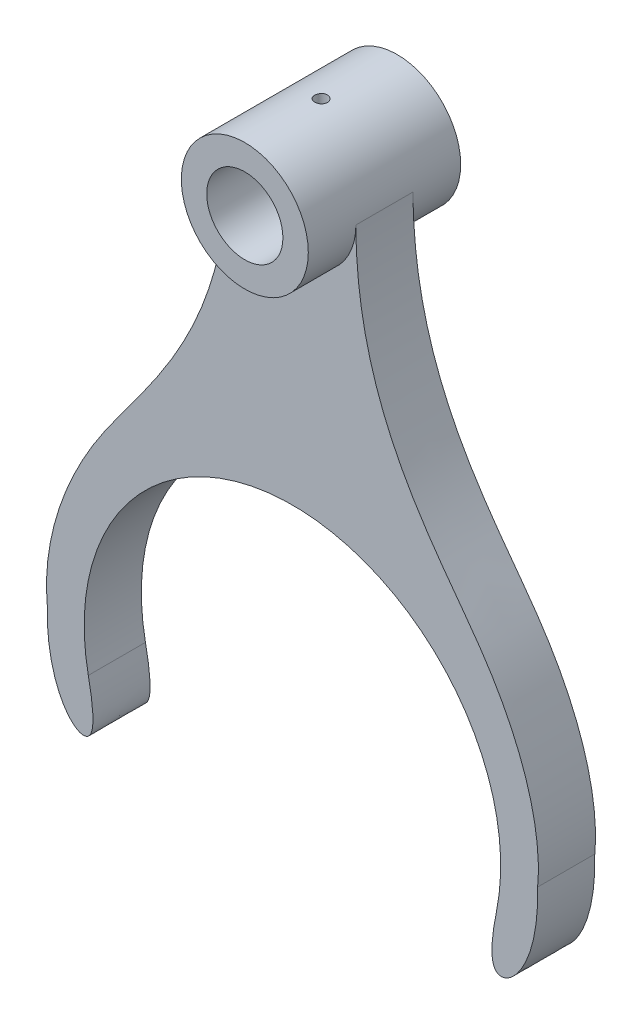
ISO-10303-21;
HEADER;
FILE_DESCRIPTION(('STEP AP214'),'2;1');
FILE_NAME('part.step','',(''),(''),'','','');
FILE_SCHEMA(('AUTOMOTIVE_DESIGN { 1 0 10303 214 1 1 1 1 }'));
ENDSEC;
DATA;
#1=APPLICATION_CONTEXT('core data for automotive mechanical design processes');
#2=APPLICATION_PROTOCOL_DEFINITION('international standard','automotive_design',2000,#1);
#3=PRODUCT_CONTEXT('',#1,'mechanical');
#4=PRODUCT('Part','Part','',(#3));
#5=PRODUCT_RELATED_PRODUCT_CATEGORY('part','',(#4));
#6=PRODUCT_DEFINITION_FORMATION('','',#4);
#7=PRODUCT_DEFINITION_CONTEXT('part definition',#1,'design');
#8=PRODUCT_DEFINITION('design','',#6,#7);
#9=PRODUCT_DEFINITION_SHAPE('','',#8);
#10=(LENGTH_UNIT() NAMED_UNIT(*) SI_UNIT(.MILLI.,.METRE.));
#11=(NAMED_UNIT(*) PLANE_ANGLE_UNIT() SI_UNIT($,.RADIAN.));
#12=(NAMED_UNIT(*) SI_UNIT($,.STERADIAN.) SOLID_ANGLE_UNIT());
#13=UNCERTAINTY_MEASURE_WITH_UNIT(LENGTH_MEASURE(1.E-05),#10,'distance_accuracy_value','');
#14=(GEOMETRIC_REPRESENTATION_CONTEXT(3) GLOBAL_UNCERTAINTY_ASSIGNED_CONTEXT((#13)) GLOBAL_UNIT_ASSIGNED_CONTEXT((#10,
#11,#12)) REPRESENTATION_CONTEXT('',''));
#15=CARTESIAN_POINT('',(0.,0.,0.));
#16=DIRECTION('',(0.,0.,1.));
#17=DIRECTION('',(1.,0.,0.));
#18=AXIS2_PLACEMENT_3D('',#15,#16,#17);
#19=CARTESIAN_POINT('',(0.,190.,30.));
#20=DIRECTION('',(0.,0.,-1.));
#21=DIRECTION('',(-1.,0.,0.));
#22=AXIS2_PLACEMENT_3D('',#19,#20,#21);
#23=CYLINDRICAL_SURFACE('',#22,15.);
#24=CARTESIAN_POINT('',(0.,190.,-30.));
#25=DIRECTION('',(0.,0.,1.));
#26=DIRECTION('',(1.,0.,0.));
#27=AXIS2_PLACEMENT_3D('',#24,#25,#26);
#28=CIRCLE('',#27,15.);
#29=CARTESIAN_POINT('',(15.,190.,-30.));
#30=VERTEX_POINT('',#29);
#31=EDGE_CURVE('E238',#30,#30,#28,.T.);
#32=ORIENTED_EDGE('',*,*,#31,.F.);
#33=EDGE_LOOP('',(#32));
#34=FACE_BOUND('',#33,.T.);
#35=CARTESIAN_POINT('',(0.,190.,30.));
#36=DIRECTION('',(0.,0.,1.));
#37=DIRECTION('',(1.,0.,0.));
#38=AXIS2_PLACEMENT_3D('',#35,#36,#37);
#39=CIRCLE('',#38,15.);
#40=CARTESIAN_POINT('',(15.,190.,30.));
#41=VERTEX_POINT('',#40);
#42=EDGE_CURVE('E237',#41,#41,#39,.T.);
#43=ORIENTED_EDGE('',*,*,#42,.T.);
#44=EDGE_LOOP('',(#43));
#45=FACE_BOUND('',#44,.T.);
#46=CARTESIAN_POINT('',(0.,205.,-2.5));
#47=CARTESIAN_POINT('',(-0.139390904958215,204.999997611688,-2.49999441105218));
#48=CARTESIAN_POINT('',(-0.278857881838821,204.99803677913,-2.48830272503108));
#49=CARTESIAN_POINT('',(-0.553880221673043,204.990403449414,-2.44186434123467));
#50=CARTESIAN_POINT('',(-0.689431867959247,204.984727539239,-2.4070964430884));
#51=CARTESIAN_POINT('',(-0.952604747212644,204.970300682365,-2.31558455140725));
#52=CARTESIAN_POINT('',(-1.0802323684319,204.961552251592,-2.25885853435943));
#53=CARTESIAN_POINT('',(-1.32414184197795,204.941942270821,-2.1250877079476));
#54=CARTESIAN_POINT('',(-1.44042498987859,204.931080962544,-2.048045222517));
#55=CARTESIAN_POINT('',(-1.65947261429168,204.908333174583,-1.87504491617954));
#56=CARTESIAN_POINT('',(-1.76211290353497,204.896438718149,-1.77893088536387));
#57=CARTESIAN_POINT('',(-1.94988849865993,204.873026268767,-1.57085203152719));
#58=CARTESIAN_POINT('',(-2.03502269939097,204.861508299627,-1.45888620854339));
#59=CARTESIAN_POINT('',(-2.18586712560513,204.840075657598,-1.22142903380295));
#60=CARTESIAN_POINT('',(-2.251454552861,204.830171290916,-1.09585866319525));
#61=CARTESIAN_POINT('',(-2.36055836541122,204.813197897947,-0.835290435699375));
#62=CARTESIAN_POINT('',(-2.40407624156561,204.806128680143,-0.700293216322369));
#63=CARTESIAN_POINT('',(-2.46741437778481,204.795705368428,-0.426019725143461));
#64=CARTESIAN_POINT('',(-2.4874490291354,204.792317684857,-0.286794263498608));
#65=CARTESIAN_POINT('',(-2.50391672528988,204.789539389366,-0.00691972311652866));
#66=CARTESIAN_POINT('',(-2.500351440389,204.790148494572,0.133729254167299));
#67=CARTESIAN_POINT('',(-2.46989509839615,204.795264288636,0.410927861275449));
#68=CARTESIAN_POINT('',(-2.44324488188977,204.799730733189,0.547504803545233));
#69=CARTESIAN_POINT('',(-2.36775314040344,204.81199495211,0.814221317829134));
#70=CARTESIAN_POINT('',(-2.31891085431974,204.819792840733,0.944360668888546));
#71=CARTESIAN_POINT('',(-2.20017724609391,204.837884793341,1.19522882344092));
#72=CARTESIAN_POINT('',(-2.13018591387971,204.848190671073,1.31590940608123));
#73=CARTESIAN_POINT('',(-1.97121201755743,204.87012918415,1.54390440053839));
#74=CARTESIAN_POINT('',(-1.88222792065429,204.881761926543,1.65121773245493));
#75=CARTESIAN_POINT('',(-1.68648221215905,204.905220278798,1.85082608580735));
#76=CARTESIAN_POINT('',(-1.57951396387313,204.917046492317,1.94291851854008));
#77=CARTESIAN_POINT('',(-1.35153524898165,204.939426013967,2.10787776266534));
#78=CARTESIAN_POINT('',(-1.23052469190642,204.949979313898,2.18074445018323));
#79=CARTESIAN_POINT('',(-0.977705916166711,204.968638928929,2.30520222713628));
#80=CARTESIAN_POINT('',(-0.84588872556466,204.976743184075,2.35677541933126));
#81=CARTESIAN_POINT('',(-0.57529834560273,204.989575030127,2.43699421524598));
#82=CARTESIAN_POINT('',(-0.436525739179467,204.994302903505,2.46564173697372));
#83=CARTESIAN_POINT('',(-0.157709901301624,204.999811298427,2.49892135846113));
#84=CARTESIAN_POINT('',(-0.0177007371510114,205.000637530128,2.50383157180561));
#85=CARTESIAN_POINT('',(0.261139772889887,204.998374744212,2.49023865557188));
#86=CARTESIAN_POINT('',(0.399971163892038,204.995285877241,2.47173642686626));
#87=CARTESIAN_POINT('',(0.671656175546764,204.985568269382,2.41207515066452));
#88=CARTESIAN_POINT('',(0.80454086838538,204.978961048013,2.37105379160987));
#89=CARTESIAN_POINT('',(1.06154688486044,204.962944644554,2.26766548180047));
#90=CARTESIAN_POINT('',(1.18566771590972,204.95353530512,2.20529733236473));
#91=CARTESIAN_POINT('',(1.42283068946896,204.932845163024,2.06034887530321));
#92=CARTESIAN_POINT('',(1.53576525093715,204.92154855887,1.97759484383275));
#93=CARTESIAN_POINT('',(1.74624358550269,204.898384673919,1.79446268461494));
#94=CARTESIAN_POINT('',(1.84378623969658,204.886517351715,1.69408327672333));
#95=CARTESIAN_POINT('',(2.021742779658,204.863401752358,1.47730245192858));
#96=CARTESIAN_POINT('',(2.10196876111372,204.852161161371,1.36074583448559));
#97=CARTESIAN_POINT('',(2.24170231029499,204.831715297779,1.11564703086146));
#98=CARTESIAN_POINT('',(2.30121053476982,204.82250996066,0.987105224772504));
#99=CARTESIAN_POINT('',(2.39753833147315,204.807234536977,0.722210267187867));
#100=CARTESIAN_POINT('',(2.43445143254795,204.801151543111,0.585891904969511));
#101=CARTESIAN_POINT('',(2.48483545377828,204.792777168353,0.308879870778237));
#102=CARTESIAN_POINT('',(2.49830841194617,204.790485457827,0.168186580267947));
#103=CARTESIAN_POINT('',(2.50137286604735,204.78996733084,-0.11170516596241));
#104=CARTESIAN_POINT('',(2.49126013612519,204.791690565057,-0.25090037857529));
#105=CARTESIAN_POINT('',(2.44807983895685,204.798897814537,-0.525579248050767));
#106=CARTESIAN_POINT('',(2.41501234611248,204.804381817612,-0.661062916941873));
#107=CARTESIAN_POINT('',(2.3269744895949,204.818473562817,-0.924358437292615));
#108=CARTESIAN_POINT('',(2.27202959060044,204.827077672197,-1.05217901005603));
#109=CARTESIAN_POINT('',(2.14182700391591,204.846443689222,-1.29683566919485));
#110=CARTESIAN_POINT('',(2.06656830874856,204.857205703884,-1.41367121037214));
#111=CARTESIAN_POINT('',(1.89681888437215,204.879834540456,-1.63453558310776));
#112=CARTESIAN_POINT('',(1.80211056359364,204.891712955763,-1.73839601670028));
#113=CARTESIAN_POINT('',(1.59660903138023,204.915143723608,-1.92885160447494));
#114=CARTESIAN_POINT('',(1.48581211291263,204.926696000266,-2.01544276863817));
#115=CARTESIAN_POINT('',(1.25036916964028,204.948265296422,-2.16944826819995));
#116=CARTESIAN_POINT('',(1.12563278753281,204.958271162531,-2.23672603931295));
#117=CARTESIAN_POINT('',(0.866513069378978,204.975511676018,-2.34926948460992));
#118=CARTESIAN_POINT('',(0.732139494830007,204.982749081775,-2.3945570810797));
#119=CARTESIAN_POINT('',(0.497703310045399,204.99205790833,-2.45200527412667));
#120=CARTESIAN_POINT('',(0.399058830298446,204.995020272734,-2.46997446961596));
#121=CARTESIAN_POINT('',(0.200289310319808,204.998992159861,-2.49397373784475));
#122=CARTESIAN_POINT('',(0.100164295608494,205.000001716206,-2.50000401613736));
#123=CARTESIAN_POINT('',(0.,205.,-2.5));
#124=B_SPLINE_CURVE_WITH_KNOTS('',3,(#46,#47,#48,#49,#50,#51,#52,#53,#54,#55,#56,#57,#58,#59,
#60,#61,#62,#63,#64,#65,#66,#67,#68,#69,#70,#71,#72,#73,#74,#75,#76,#77,#78,#79,#80,#81,#82,#83,
#84,#85,#86,#87,#88,#89,#90,#91,#92,#93,#94,#95,#96,#97,#98,#99,#100,#101,#102,#103,#104,#105,
#106,#107,#108,#109,#110,#111,#112,#113,#114,#115,#116,#117,#118,#119,#120,#121,#122,#123),
.UNSPECIFIED.,.T.,.F.,(4,2,2,2,2,2,2,2,2,2,2,2,2,2,2,2,2,2,2,2,2,2,2,2,2,2,2,2,2,2,2,2,2,2,2,2,
2,2,4),(0.,0.41780658493851,0.83599754569542,1.25384686702527,1.67164841267479,2.09302491062332,
2.51442800169856,2.9384252082384,3.36239376876181,3.78246077103424,4.20249804320886,
4.61820521760409,5.03392665025381,5.45164556632557,5.86939820680573,6.29232769911326,
6.71525991635847,7.13854688915903,7.56179844521149,7.98007883491397,8.39834313035859,
8.81407807006415,9.22983635826066,9.64926825627023,10.0687306305428,10.4925382200762,
10.9163323737594,11.3383602234177,11.7603513778662,12.177079095227,12.5938054618813,
13.0100481822622,13.4263115502934,13.8475138419339,14.2688133387897,14.693022316072,
15.1168075213007,15.4170424816402,15.7172722727697),.UNSPECIFIED.);
#125=CARTESIAN_POINT('',(0.,205.,-2.5));
#126=VERTEX_POINT('',#125);
#127=EDGE_CURVE('E242',#126,#126,#124,.T.);
#128=ORIENTED_EDGE('',*,*,#127,.T.);
#129=EDGE_LOOP('',(#128));
#130=FACE_BOUND('',#129,.T.);
#131=ADVANCED_FACE('F45',(#34,#45,#130),#23,.F.);
#132=CARTESIAN_POINT('',(0.,190.,30.));
#133=DIRECTION('',(0.,0.,-1.));
#134=DIRECTION('',(-1.,0.,0.));
#135=AXIS2_PLACEMENT_3D('',#132,#133,#134);
#136=CYLINDRICAL_SURFACE('',#135,25.);
#137=CARTESIAN_POINT('',(0.,190.,11.25));
#138=DIRECTION('',(0.,0.,1.));
#139=DIRECTION('',(1.,0.,0.));
#140=AXIS2_PLACEMENT_3D('',#137,#138,#139);
#141=CIRCLE('',#140,25.);
#142=CARTESIAN_POINT('',(-25.,190.,11.25));
#143=VERTEX_POINT('',#142);
#144=CARTESIAN_POINT('',(25.,190.,11.25));
#145=VERTEX_POINT('',#144);
#146=EDGE_CURVE('E219',#143,#145,#141,.T.);
#147=ORIENTED_EDGE('',*,*,#146,.T.);
#148=DIRECTION('',(0.,0.,-1.));
#149=VECTOR('',#148,1.);
#150=CARTESIAN_POINT('',(25.,190.,11.25));
#151=LINE('',#150,#149);
#152=CARTESIAN_POINT('',(25.,190.,-11.25));
#153=VERTEX_POINT('',#152);
#154=EDGE_CURVE('E116',#145,#153,#151,.T.);
#155=ORIENTED_EDGE('',*,*,#154,.T.);
#156=CARTESIAN_POINT('',(0.,190.,-11.25));
#157=DIRECTION('',(0.,0.,1.));
#158=DIRECTION('',(1.,0.,0.));
#159=AXIS2_PLACEMENT_3D('',#156,#157,#158);
#160=CIRCLE('',#159,25.);
#161=CARTESIAN_POINT('',(-25.,190.,-11.25));
#162=VERTEX_POINT('',#161);
#163=EDGE_CURVE('E109',#162,#153,#160,.T.);
#164=ORIENTED_EDGE('',*,*,#163,.F.);
#165=DIRECTION('',(0.,0.,-1.));
#166=VECTOR('',#165,1.);
#167=CARTESIAN_POINT('',(-25.,190.,11.25));
#168=LINE('',#167,#166);
#169=EDGE_CURVE('E113',#143,#162,#168,.T.);
#170=ORIENTED_EDGE('',*,*,#169,.F.);
#171=EDGE_LOOP('',(#147,#155,#164,#170));
#172=FACE_BOUND('',#171,.T.);
#173=CARTESIAN_POINT('',(0.,190.,30.));
#174=DIRECTION('',(0.,0.,1.));
#175=DIRECTION('',(1.,0.,0.));
#176=AXIS2_PLACEMENT_3D('',#173,#174,#175);
#177=CIRCLE('',#176,25.);
#178=CARTESIAN_POINT('',(25.,190.,30.));
#179=VERTEX_POINT('',#178);
#180=EDGE_CURVE('E171',#179,#179,#177,.T.);
#181=ORIENTED_EDGE('',*,*,#180,.F.);
#182=EDGE_LOOP('',(#181));
#183=FACE_BOUND('',#182,.T.);
#184=CARTESIAN_POINT('',(0.,190.,-30.));
#185=DIRECTION('',(0.,0.,1.));
#186=DIRECTION('',(1.,0.,0.));
#187=AXIS2_PLACEMENT_3D('',#184,#185,#186);
#188=CIRCLE('',#187,25.);
#189=CARTESIAN_POINT('',(25.,190.,-30.));
#190=VERTEX_POINT('',#189);
#191=EDGE_CURVE('E233',#190,#190,#188,.T.);
#192=ORIENTED_EDGE('',*,*,#191,.T.);
#193=EDGE_LOOP('',(#192));
#194=FACE_BOUND('',#193,.T.);
#195=CARTESIAN_POINT('',(0.,215.,-2.5));
#196=CARTESIAN_POINT('',(-0.140050884478893,214.999998388019,-2.49999393524905));
#197=CARTESIAN_POINT('',(-0.280194362919433,214.998810639905,-2.48819182775889));
#198=CARTESIAN_POINT('',(-0.556595996242093,214.994186689868,-2.44128907427393));
#199=CARTESIAN_POINT('',(-0.69284969792207,214.990748010851,-2.40616275993853));
#200=CARTESIAN_POINT('',(-0.957429188633537,214.982010364077,-2.31364439850542));
#201=CARTESIAN_POINT('',(-1.08575971153727,214.976712520018,-2.25626579870381));
#202=CARTESIAN_POINT('',(-1.33094040240102,214.964848934858,-2.12089773017089));
#203=CARTESIAN_POINT('',(-1.44779284694769,214.958283445953,-2.04291235999965));
#204=CARTESIAN_POINT('',(-1.66714887668521,214.944593608533,-1.86824325584431));
#205=CARTESIAN_POINT('',(-1.76960536208723,214.937467539347,-1.77150050149491));
#206=CARTESIAN_POINT('',(-1.95685630357746,214.923473922657,-1.56218866434242));
#207=CARTESIAN_POINT('',(-2.04164994270663,214.916606387123,-1.44961884989403));
#208=CARTESIAN_POINT('',(-2.19133492610904,214.90388978882,-1.21155367079095));
#209=CARTESIAN_POINT('',(-2.2561836636372,214.898042917773,-1.08603138976285));
#210=CARTESIAN_POINT('',(-2.3638659618569,214.888050938663,-0.825811035237551));
#211=CARTESIAN_POINT('',(-2.40670006647823,214.883905788556,-0.691113188540124));
#212=CARTESIAN_POINT('',(-2.46899760400473,214.877802101824,-0.416845497834975));
#213=CARTESIAN_POINT('',(-2.48853913250949,214.875836259952,-0.277293557869478));
#214=CARTESIAN_POINT('',(-2.5039382128384,214.874291076513,0.00312215848945237));
#215=CARTESIAN_POINT('',(-2.499796387177,214.874711672219,0.143985900305149));
#216=CARTESIAN_POINT('',(-2.4680107006317,214.877885172473,0.422488274233296));
#217=CARTESIAN_POINT('',(-2.44045211031138,214.880629614766,0.560136748321736));
#218=CARTESIAN_POINT('',(-2.36274786037647,214.888128357185,0.828844908002735));
#219=CARTESIAN_POINT('',(-2.31260189563937,214.892882684462,0.959904504562579));
#220=CARTESIAN_POINT('',(-2.19105223470377,214.903875236302,1.21198396824722));
#221=CARTESIAN_POINT('',(-2.11961070679995,214.910116097704,1.33298547372329));
#222=CARTESIAN_POINT('',(-1.95752506838307,214.923376293322,1.56131303727971));
#223=CARTESIAN_POINT('',(-1.86688039584126,214.93039565032,1.66863869495441));
#224=CARTESIAN_POINT('',(-1.66848528103017,214.944459632825,1.86706348497257));
#225=CARTESIAN_POINT('',(-1.56066119712841,214.951504233325,1.95808900470201));
#226=CARTESIAN_POINT('',(-1.33122370434278,214.964795726963,2.12075908227597));
#227=CARTESIAN_POINT('',(-1.209610279999,214.971042619206,2.19240361839119));
#228=CARTESIAN_POINT('',(-0.955995264230911,214.982036891677,2.31427505077563));
#229=CARTESIAN_POINT('',(-0.823991865974757,214.986784010369,2.36449821204515));
#230=CARTESIAN_POINT('',(-0.553368043324829,214.994241186035,2.44204729177938));
#231=CARTESIAN_POINT('',(-0.4147478169415,214.996951303927,2.46937389497656));
#232=CARTESIAN_POINT('',(-0.135462747729759,215.000021291708,2.50026076933691));
#233=CARTESIAN_POINT('',(0.00519075526373068,215.000391206693,2.50392262063125));
#234=CARTESIAN_POINT('',(0.28510948328925,214.99876604392,2.48764284237809));
#235=CARTESIAN_POINT('',(0.424374727051175,214.996770998112,2.4677015317118));
#236=CARTESIAN_POINT('',(0.697270517086685,214.99064653848,2.40486576144606));
#237=CARTESIAN_POINT('',(0.830912122430046,214.986521547951,2.36201886380497));
#238=CARTESIAN_POINT('',(1.08911080345945,214.976599971515,2.25463706490682));
#239=CARTESIAN_POINT('',(1.21366767539279,214.970803348131,2.19010167740151));
#240=CARTESIAN_POINT('',(1.45062045043035,214.958161883261,2.04092290334022));
#241=CARTESIAN_POINT('',(1.56297414937229,214.951313590086,1.95621277768546));
#242=CARTESIAN_POINT('',(1.77190405827969,214.937348321738,1.76918483064768));
#243=CARTESIAN_POINT('',(1.86847987212294,214.930231339824,1.66686656732421));
#244=CARTESIAN_POINT('',(2.04346527471786,214.916500603519,1.4470835633525));
#245=CARTESIAN_POINT('',(2.12180819669886,214.909888753474,1.32956560864345));
#246=CARTESIAN_POINT('',(2.25764564685957,214.897945811522,1.08298159963329));
#247=CARTESIAN_POINT('',(2.3151404601347,214.892614702101,0.95391570327901));
#248=CARTESIAN_POINT('',(2.40753802171119,214.883848690851,0.688128151335515));
#249=CARTESIAN_POINT('',(2.44248043702965,214.880410461245,0.551420399772198));
#250=CARTESIAN_POINT('',(2.48891001782366,214.875809132072,0.27404200509807));
#251=CARTESIAN_POINT('',(2.50039785599879,214.874645967255,0.133371475760815));
#252=CARTESIAN_POINT('',(2.49958284617814,214.874727827689,-0.147276720891762));
#253=CARTESIAN_POINT('',(2.48738472398278,214.875962252175,-0.287254707207038));
#254=CARTESIAN_POINT('',(2.43976363240913,214.880677597239,-0.56316229292072));
#255=CARTESIAN_POINT('',(2.4043406369054,214.884158520343,-0.699091887764949));
#256=CARTESIAN_POINT('',(2.31130421574376,214.89297170658,-0.963043372619642));
#257=CARTESIAN_POINT('',(2.25369386085229,214.898303713509,-1.09106635407431));
#258=CARTESIAN_POINT('',(2.11792888727761,214.910218795984,-1.33564222917759));
#259=CARTESIAN_POINT('',(2.03977438363854,214.916801864524,-1.45219518705157));
#260=CARTESIAN_POINT('',(1.86474639071333,214.930512180242,-1.67105918617984));
#261=CARTESIAN_POINT('',(1.76779487222567,214.937641618169,-1.77330769091772));
#262=CARTESIAN_POINT('',(1.55807924806277,214.95162136822,-1.96013058174914));
#263=CARTESIAN_POINT('',(1.44531136027064,214.958471613074,-2.04470072839292));
#264=CARTESIAN_POINT('',(1.20685358540322,214.971139051729,-2.19393363463655));
#265=CARTESIAN_POINT('',(1.08113187336691,214.97695360067,-2.25854572736296));
#266=CARTESIAN_POINT('',(0.820645697751376,214.986865731247,-2.36565605705967));
#267=CARTESIAN_POINT('',(0.685891624564022,214.990965247741,-2.40817922738387));
#268=CARTESIAN_POINT('',(0.458645653514261,214.995955344343,-2.459301542712));
#269=CARTESIAN_POINT('',(0.367606382111272,214.997465017296,-2.47454261074839));
#270=CARTESIAN_POINT('',(0.184391452043283,214.99948787377,-2.4948938151544));
#271=CARTESIAN_POINT('',(0.0922157980663947,215.000001061401,-2.50000399330465));
#272=CARTESIAN_POINT('',(0.,215.,-2.5));
#273=B_SPLINE_CURVE_WITH_KNOTS('',3,(#195,#196,#197,#198,#199,#200,#201,#202,#203,#204,#205,
#206,#207,#208,#209,#210,#211,#212,#213,#214,#215,#216,#217,#218,#219,#220,#221,#222,#223,#224,
#225,#226,#227,#228,#229,#230,#231,#232,#233,#234,#235,#236,#237,#238,#239,#240,#241,#242,#243,
#244,#245,#246,#247,#248,#249,#250,#251,#252,#253,#254,#255,#256,#257,#258,#259,#260,#261,#262,
#263,#264,#265,#266,#267,#268,#269,#270,#271,#272),.UNSPECIFIED.,.T.,.F.,(4,2,2,2,2,2,2,2,2,2,2,
2,2,2,2,2,2,2,2,2,2,2,2,2,2,2,2,2,2,2,2,2,2,2,2,2,2,2,4),(0.,0.419815915671184,
0.840094607088716,1.26011971433051,1.68006134395696,2.10134642155736,2.52265098051765,
2.94484938680555,3.3670373610626,3.78780580112992,4.20856318139441,4.62779493602776,
5.04703235404084,5.46701903432237,5.88701800827813,6.30886835490516,6.73071917449429,
7.15264351733954,7.57455524188599,7.99465471519394,8.41474851297858,8.83397338235761,
9.25320765123667,9.67384851871746,10.0944999452557,10.516666090215,10.9388264618844,
11.3602422648251,11.7816459809896,12.2011907323489,12.620735955651,13.04022313407,
13.459707963474,13.8809729356913,14.3023388159239,14.7247657756561,15.1467148698824,
15.4231416808087,15.6995673517257),.UNSPECIFIED.);
#274=CARTESIAN_POINT('',(0.,215.,-2.5));
#275=VERTEX_POINT('',#274);
#276=EDGE_CURVE('E11',#275,#275,#273,.T.);
#277=ORIENTED_EDGE('',*,*,#276,.F.);
#278=EDGE_LOOP('',(#277));
#279=FACE_BOUND('',#278,.T.);
#280=ADVANCED_FACE('F111',(#172,#183,#194,#279),#136,.T.);
#281=CARTESIAN_POINT('',(0.,0.,11.25));
#282=DIRECTION('',(0.,0.,-1.));
#283=DIRECTION('',(-1.,0.,0.));
#284=AXIS2_PLACEMENT_3D('',#281,#282,#283);
#285=CYLINDRICAL_SURFACE('',#284,82.);
#286=CARTESIAN_POINT('',(0.,0.,-11.25));
#287=DIRECTION('',(0.,0.,1.));
#288=DIRECTION('',(1.,0.,0.));
#289=AXIS2_PLACEMENT_3D('',#286,#287,#288);
#290=CIRCLE('',#289,82.);
#291=CARTESIAN_POINT('',(80.3693461483978,-16.271699348225,-11.25));
#292=VERTEX_POINT('',#291);
#293=CARTESIAN_POINT('',(-80.3693461483978,-16.271699348225,-11.25));
#294=VERTEX_POINT('',#293);
#295=EDGE_CURVE('E169',#292,#294,#290,.T.);
#296=ORIENTED_EDGE('',*,*,#295,.F.);
#297=DIRECTION('',(0.,0.,-1.));
#298=VECTOR('',#297,1.);
#299=CARTESIAN_POINT('',(80.3693461483978,-16.271699348225,11.25));
#300=LINE('',#299,#298);
#301=CARTESIAN_POINT('',(80.3693461483978,-16.271699348225,11.25));
#302=VERTEX_POINT('',#301);
#303=EDGE_CURVE('E60',#302,#292,#300,.T.);
#304=ORIENTED_EDGE('',*,*,#303,.F.);
#305=CARTESIAN_POINT('',(0.,0.,11.25));
#306=DIRECTION('',(0.,0.,1.));
#307=DIRECTION('',(1.,0.,0.));
#308=AXIS2_PLACEMENT_3D('',#305,#306,#307);
#309=CIRCLE('',#308,82.);
#310=CARTESIAN_POINT('',(-80.3693461483978,-16.271699348225,11.25));
#311=VERTEX_POINT('',#310);
#312=EDGE_CURVE('E138',#302,#311,#309,.T.);
#313=ORIENTED_EDGE('',*,*,#312,.T.);
#314=DIRECTION('',(0.,0.,-1.));
#315=VECTOR('',#314,1.);
#316=CARTESIAN_POINT('',(-80.3693461483978,-16.271699348225,11.25));
#317=LINE('',#316,#315);
#318=EDGE_CURVE('E95',#311,#294,#317,.T.);
#319=ORIENTED_EDGE('',*,*,#318,.T.);
#320=EDGE_LOOP('',(#296,#304,#313,#319));
#321=FACE_BOUND('',#320,.T.);
#322=ADVANCED_FACE('F47',(#321),#285,.F.);
#323=CARTESIAN_POINT('',(96.5397451551602,0.,11.25));
#324=CARTESIAN_POINT('',(97.3265589392812,-29.3315351342893,11.25));
#325=CARTESIAN_POINT('',(77.4734920130336,-47.5739427445997,11.25));
#326=CARTESIAN_POINT('',(78.1124793524227,-27.4188392292438,11.25));
#327=CARTESIAN_POINT('',(80.3693461483978,-16.271699348225,11.25));
#328=B_SPLINE_CURVE_WITH_KNOTS('',3,(#323,#324,#325,#326,#327),.UNSPECIFIED.,.F.,.F.,(4,1,4),
(0.,0.6637240288713,1.),.UNSPECIFIED.);
#329=DIRECTION('',(0.,0.,-1.));
#330=VECTOR('',#329,1.);
#331=SURFACE_OF_LINEAR_EXTRUSION('',#328,#330);
#332=CARTESIAN_POINT('',(96.5397451551602,0.,-11.25));
#333=CARTESIAN_POINT('',(97.3265589392812,-29.3315351342893,-11.25));
#334=CARTESIAN_POINT('',(77.4734920130336,-47.5739427445997,-11.25));
#335=CARTESIAN_POINT('',(78.1124793524227,-27.4188392292438,-11.25));
#336=CARTESIAN_POINT('',(80.3693461483978,-16.271699348225,-11.25));
#337=B_SPLINE_CURVE_WITH_KNOTS('',3,(#332,#333,#334,#335,#336),.UNSPECIFIED.,.F.,.F.,(4,1,4),
(0.,0.6637240288713,1.),.UNSPECIFIED.);
#338=CARTESIAN_POINT('',(96.5397451551602,0.,-11.25));
#339=VERTEX_POINT('',#338);
#340=EDGE_CURVE('E166',#339,#292,#337,.T.);
#341=ORIENTED_EDGE('',*,*,#340,.F.);
#342=DIRECTION('',(0.,0.,-1.));
#343=VECTOR('',#342,1.);
#344=CARTESIAN_POINT('',(96.5397451551602,0.,11.25));
#345=LINE('',#344,#343);
#346=CARTESIAN_POINT('',(96.5397451551602,0.,11.25));
#347=VERTEX_POINT('',#346);
#348=EDGE_CURVE('E158',#347,#339,#345,.T.);
#349=ORIENTED_EDGE('',*,*,#348,.F.);
#350=EDGE_CURVE('E168',#347,#302,#328,.T.);
#351=ORIENTED_EDGE('',*,*,#350,.T.);
#352=ORIENTED_EDGE('',*,*,#303,.T.);
#353=EDGE_LOOP('',(#341,#349,#351,#352));
#354=FACE_BOUND('',#353,.T.);
#355=ADVANCED_FACE('F164',(#354),#331,.T.);
#356=CARTESIAN_POINT('',(96.5397451551602,0.,11.25));
#357=CARTESIAN_POINT('',(96.4933319122197,1.73023362513809,11.25));
#358=CARTESIAN_POINT('',(104.346209233842,48.7694926730542,11.25));
#359=CARTESIAN_POINT('',(25.,126.8484207509,11.25));
#360=CARTESIAN_POINT('',(25.,190.,11.25));
#361=B_SPLINE_CURVE_WITH_KNOTS('',3,(#356,#357,#358,#359,#360),.UNSPECIFIED.,.F.,.F.,(4,1,4),
(0.,0.598565742576659,1.),.UNSPECIFIED.);
#362=DIRECTION('',(0.,0.,-1.));
#363=VECTOR('',#362,1.);
#364=SURFACE_OF_LINEAR_EXTRUSION('',#361,#363);
#365=CARTESIAN_POINT('',(96.5397451551602,0.,-11.25));
#366=CARTESIAN_POINT('',(96.4933319122197,1.73023362513809,-11.25));
#367=CARTESIAN_POINT('',(104.346209233842,48.7694926730542,-11.25));
#368=CARTESIAN_POINT('',(25.,126.8484207509,-11.25));
#369=CARTESIAN_POINT('',(25.,190.,-11.25));
#370=B_SPLINE_CURVE_WITH_KNOTS('',3,(#365,#366,#367,#368,#369),.UNSPECIFIED.,.F.,.F.,(4,1,4),
(0.,0.598565742576659,1.),.UNSPECIFIED.);
#371=EDGE_CURVE('E123',#339,#153,#370,.T.);
#372=ORIENTED_EDGE('',*,*,#371,.T.);
#373=ORIENTED_EDGE('',*,*,#154,.F.);
#374=EDGE_CURVE('E213',#347,#145,#361,.T.);
#375=ORIENTED_EDGE('',*,*,#374,.F.);
#376=ORIENTED_EDGE('',*,*,#348,.T.);
#377=EDGE_LOOP('',(#372,#373,#375,#376));
#378=FACE_BOUND('',#377,.T.);
#379=ADVANCED_FACE('F208',(#378),#364,.F.);
#380=CARTESIAN_POINT('',(-96.5397451551602,0.,11.25));
#381=CARTESIAN_POINT('',(-96.4933319122197,1.73023362513809,11.25));
#382=CARTESIAN_POINT('',(-104.346209233842,48.7694926730542,11.25));
#383=CARTESIAN_POINT('',(-25.,126.8484207509,11.25));
#384=CARTESIAN_POINT('',(-25.,190.,11.25));
#385=B_SPLINE_CURVE_WITH_KNOTS('',3,(#380,#381,#382,#383,#384),.UNSPECIFIED.,.F.,.F.,(4,1,4),
(0.,0.598565742576659,1.),.UNSPECIFIED.);
#386=DIRECTION('',(0.,0.,-1.));
#387=VECTOR('',#386,1.);
#388=SURFACE_OF_LINEAR_EXTRUSION('',#385,#387);
#389=CARTESIAN_POINT('',(-96.5397451551602,0.,-11.25));
#390=CARTESIAN_POINT('',(-96.4933319122197,1.73023362513809,-11.25));
#391=CARTESIAN_POINT('',(-104.346209233842,48.7694926730542,-11.25));
#392=CARTESIAN_POINT('',(-25.,126.8484207509,-11.25));
#393=CARTESIAN_POINT('',(-25.,190.,-11.25));
#394=B_SPLINE_CURVE_WITH_KNOTS('',3,(#389,#390,#391,#392,#393),.UNSPECIFIED.,.F.,.F.,(4,1,4),
(0.,0.598565742576659,1.),.UNSPECIFIED.);
#395=CARTESIAN_POINT('',(-96.5397451551602,0.,-11.25));
#396=VERTEX_POINT('',#395);
#397=EDGE_CURVE('E122',#396,#162,#394,.T.);
#398=ORIENTED_EDGE('',*,*,#397,.F.);
#399=DIRECTION('',(0.,0.,-1.));
#400=VECTOR('',#399,1.);
#401=CARTESIAN_POINT('',(-96.5397451551602,0.,11.25));
#402=LINE('',#401,#400);
#403=CARTESIAN_POINT('',(-96.5397451551602,0.,11.25));
#404=VERTEX_POINT('',#403);
#405=EDGE_CURVE('E88',#404,#396,#402,.T.);
#406=ORIENTED_EDGE('',*,*,#405,.F.);
#407=EDGE_CURVE('E129',#404,#143,#385,.T.);
#408=ORIENTED_EDGE('',*,*,#407,.T.);
#409=ORIENTED_EDGE('',*,*,#169,.T.);
#410=EDGE_LOOP('',(#398,#406,#408,#409));
#411=FACE_BOUND('',#410,.T.);
#412=ADVANCED_FACE('F128',(#411),#388,.T.);
#413=CARTESIAN_POINT('',(-96.5397451551602,0.,11.25));
#414=CARTESIAN_POINT('',(-97.3265589392812,-29.3315351342893,11.25));
#415=CARTESIAN_POINT('',(-77.4734920130336,-47.5739427445997,11.25));
#416=CARTESIAN_POINT('',(-78.1124793524227,-27.4188392292438,11.25));
#417=CARTESIAN_POINT('',(-80.3693461483978,-16.271699348225,11.25));
#418=B_SPLINE_CURVE_WITH_KNOTS('',3,(#413,#414,#415,#416,#417),.UNSPECIFIED.,.F.,.F.,(4,1,4),
(0.,0.6637240288713,1.),.UNSPECIFIED.);
#419=DIRECTION('',(0.,0.,-1.));
#420=VECTOR('',#419,1.);
#421=SURFACE_OF_LINEAR_EXTRUSION('',#418,#420);
#422=CARTESIAN_POINT('',(-96.5397451551602,0.,-11.25));
#423=CARTESIAN_POINT('',(-97.3265589392812,-29.3315351342893,-11.25));
#424=CARTESIAN_POINT('',(-77.4734920130336,-47.5739427445997,-11.25));
#425=CARTESIAN_POINT('',(-78.1124793524227,-27.4188392292438,-11.25));
#426=CARTESIAN_POINT('',(-80.3693461483978,-16.271699348225,-11.25));
#427=B_SPLINE_CURVE_WITH_KNOTS('',3,(#422,#423,#424,#425,#426),.UNSPECIFIED.,.F.,.F.,(4,1,4),
(0.,0.6637240288713,1.),.UNSPECIFIED.);
#428=EDGE_CURVE('E134',#396,#294,#427,.T.);
#429=ORIENTED_EDGE('',*,*,#428,.T.);
#430=ORIENTED_EDGE('',*,*,#318,.F.);
#431=EDGE_CURVE('E68',#404,#311,#418,.T.);
#432=ORIENTED_EDGE('',*,*,#431,.F.);
#433=ORIENTED_EDGE('',*,*,#405,.T.);
#434=EDGE_LOOP('',(#429,#430,#432,#433));
#435=FACE_BOUND('',#434,.T.);
#436=ADVANCED_FACE('F200',(#435),#421,.F.);
#437=CARTESIAN_POINT('',(0.,0.,11.25));
#438=DIRECTION('',(0.,0.,1.));
#439=DIRECTION('',(1.,0.,0.));
#440=AXIS2_PLACEMENT_3D('',#437,#438,#439);
#441=PLANE('',#440);
#442=ORIENTED_EDGE('',*,*,#312,.F.);
#443=ORIENTED_EDGE('',*,*,#350,.F.);
#444=ORIENTED_EDGE('',*,*,#374,.T.);
#445=ORIENTED_EDGE('',*,*,#146,.F.);
#446=ORIENTED_EDGE('',*,*,#407,.F.);
#447=ORIENTED_EDGE('',*,*,#431,.T.);
#448=EDGE_LOOP('',(#442,#443,#444,#445,#446,#447));
#449=FACE_BOUND('',#448,.T.);
#450=ADVANCED_FACE('F204',(#449),#441,.T.);
#451=CARTESIAN_POINT('',(0.,0.,-11.25));
#452=DIRECTION('',(0.,0.,1.));
#453=DIRECTION('',(1.,0.,0.));
#454=AXIS2_PLACEMENT_3D('',#451,#452,#453);
#455=PLANE('',#454);
#456=ORIENTED_EDGE('',*,*,#295,.T.);
#457=ORIENTED_EDGE('',*,*,#428,.F.);
#458=ORIENTED_EDGE('',*,*,#397,.T.);
#459=ORIENTED_EDGE('',*,*,#163,.T.);
#460=ORIENTED_EDGE('',*,*,#371,.F.);
#461=ORIENTED_EDGE('',*,*,#340,.T.);
#462=EDGE_LOOP('',(#456,#457,#458,#459,#460,#461));
#463=FACE_BOUND('',#462,.T.);
#464=ADVANCED_FACE('F133',(#463),#455,.F.);
#465=CARTESIAN_POINT('',(0.,0.,30.));
#466=DIRECTION('',(0.,0.,1.));
#467=DIRECTION('',(1.,0.,0.));
#468=AXIS2_PLACEMENT_3D('',#465,#466,#467);
#469=PLANE('',#468);
#470=ORIENTED_EDGE('',*,*,#42,.F.);
#471=EDGE_LOOP('',(#470));
#472=FACE_BOUND('',#471,.T.);
#473=ORIENTED_EDGE('',*,*,#180,.T.);
#474=EDGE_LOOP('',(#473));
#475=FACE_BOUND('',#474,.T.);
#476=ADVANCED_FACE('F262',(#472,#475),#469,.T.);
#477=CARTESIAN_POINT('',(0.,0.,-30.));
#478=DIRECTION('',(0.,0.,1.));
#479=DIRECTION('',(1.,0.,0.));
#480=AXIS2_PLACEMENT_3D('',#477,#478,#479);
#481=PLANE('',#480);
#482=ORIENTED_EDGE('',*,*,#31,.T.);
#483=EDGE_LOOP('',(#482));
#484=FACE_BOUND('',#483,.T.);
#485=ORIENTED_EDGE('',*,*,#191,.F.);
#486=EDGE_LOOP('',(#485));
#487=FACE_BOUND('',#486,.T.);
#488=ADVANCED_FACE('F260',(#484,#487),#481,.F.);
#489=CARTESIAN_POINT('',(0.,215.,0.));
#490=DIRECTION('',(0.,-1.,0.));
#491=DIRECTION('',(0.,0.,-1.));
#492=AXIS2_PLACEMENT_3D('',#489,#490,#491);
#493=CYLINDRICAL_SURFACE('',#492,2.5);
#494=ORIENTED_EDGE('',*,*,#127,.F.);
#495=EDGE_LOOP('',(#494));
#496=FACE_BOUND('',#495,.T.);
#497=ORIENTED_EDGE('',*,*,#276,.T.);
#498=EDGE_LOOP('',(#497));
#499=FACE_BOUND('',#498,.T.);
#500=ADVANCED_FACE('F256',(#496,#499),#493,.F.);
#501=CLOSED_SHELL('',(#131,#280,#322,#355,#379,#412,#436,#450,#464,#476,#488,#500));
#502=MANIFOLD_SOLID_BREP('B2',#501);
#503=ADVANCED_BREP_SHAPE_REPRESENTATION('',(#18,#502),#14);
#504=SHAPE_DEFINITION_REPRESENTATION(#9,#503);
ENDSEC;
END-ISO-10303-21;
